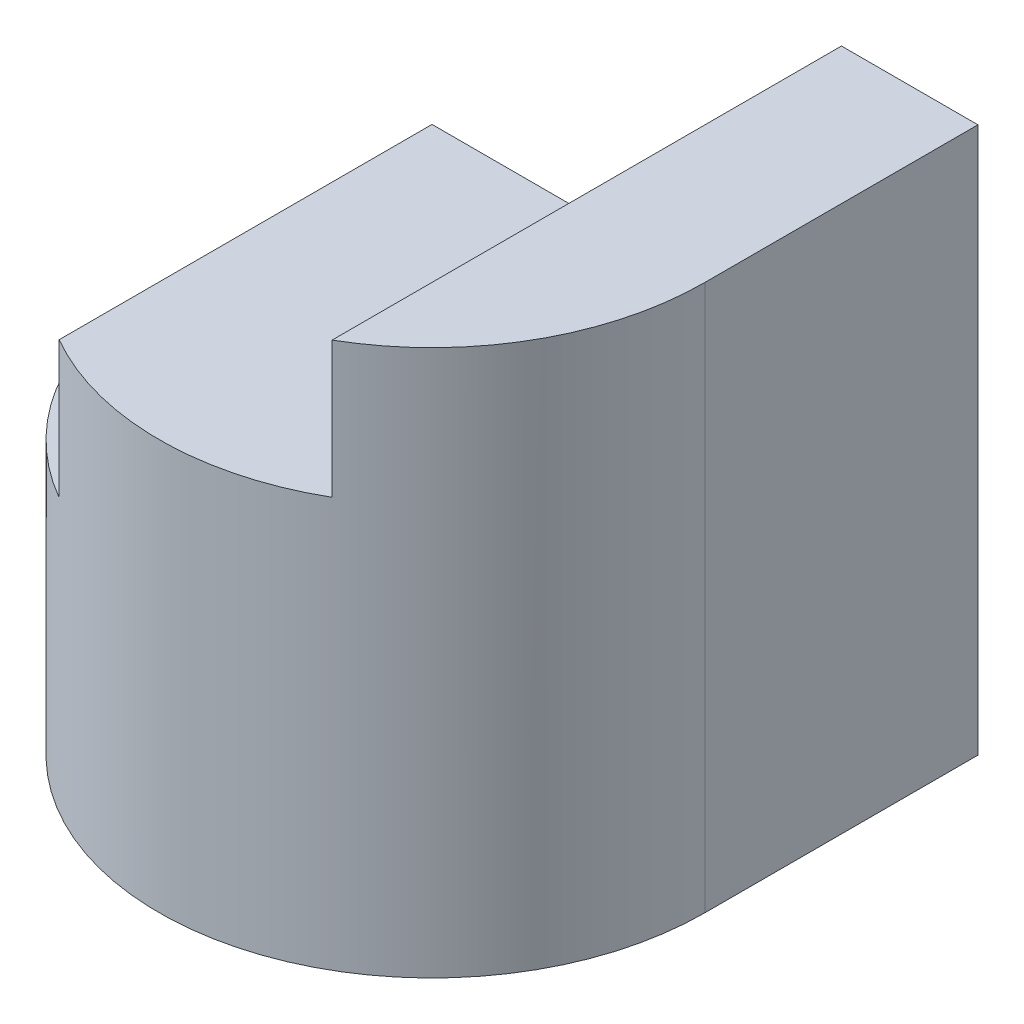
ISO-10303-21;
HEADER;
FILE_DESCRIPTION(('STEP AP214'),'2;1');
FILE_NAME('part.step','',(''),(''),'','','');
FILE_SCHEMA(('AUTOMOTIVE_DESIGN { 1 0 10303 214 1 1 1 1 }'));
ENDSEC;
DATA;
#1=APPLICATION_CONTEXT('core data for automotive mechanical design processes');
#2=APPLICATION_PROTOCOL_DEFINITION('international standard','automotive_design',2000,#1);
#3=PRODUCT_CONTEXT('',#1,'mechanical');
#4=PRODUCT('Part','Part','',(#3));
#5=PRODUCT_RELATED_PRODUCT_CATEGORY('part','',(#4));
#6=PRODUCT_DEFINITION_FORMATION('','',#4);
#7=PRODUCT_DEFINITION_CONTEXT('part definition',#1,'design');
#8=PRODUCT_DEFINITION('design','',#6,#7);
#9=PRODUCT_DEFINITION_SHAPE('','',#8);
#10=(LENGTH_UNIT() NAMED_UNIT(*) SI_UNIT(.MILLI.,.METRE.));
#11=(NAMED_UNIT(*) PLANE_ANGLE_UNIT() SI_UNIT($,.RADIAN.));
#12=(NAMED_UNIT(*) SI_UNIT($,.STERADIAN.) SOLID_ANGLE_UNIT());
#13=UNCERTAINTY_MEASURE_WITH_UNIT(LENGTH_MEASURE(1.E-05),#10,'distance_accuracy_value','');
#14=(GEOMETRIC_REPRESENTATION_CONTEXT(3) GLOBAL_UNCERTAINTY_ASSIGNED_CONTEXT((#13)) GLOBAL_UNIT_ASSIGNED_CONTEXT((#10,
#11,#12)) REPRESENTATION_CONTEXT('',''));
#15=CARTESIAN_POINT('',(0.,0.,0.));
#16=DIRECTION('',(0.,0.,1.));
#17=DIRECTION('',(1.,0.,0.));
#18=AXIS2_PLACEMENT_3D('',#15,#16,#17);
#19=CARTESIAN_POINT('',(-1.,4.,-2.));
#20=DIRECTION('',(0.,0.,1.));
#21=DIRECTION('',(1.,0.,0.));
#22=AXIS2_PLACEMENT_3D('',#19,#20,#21);
#23=PLANE('',#22);
#24=DIRECTION('',(0.,-1.,0.));
#25=VECTOR('',#24,1.);
#26=CARTESIAN_POINT('',(-2.,4.,-2.));
#27=LINE('',#26,#25);
#28=CARTESIAN_POINT('',(-2.,2.,-2.));
#29=VERTEX_POINT('',#28);
#30=CARTESIAN_POINT('',(-2.,0.,-2.));
#31=VERTEX_POINT('',#30);
#32=EDGE_CURVE('E40',#29,#31,#27,.T.);
#33=ORIENTED_EDGE('',*,*,#32,.F.);
#34=DIRECTION('',(-1.,0.,0.));
#35=VECTOR('',#34,1.);
#36=CARTESIAN_POINT('',(-1.,2.,-2.));
#37=LINE('',#36,#35);
#38=CARTESIAN_POINT('',(-1.,2.,-2.));
#39=VERTEX_POINT('',#38);
#40=EDGE_CURVE('E120',#39,#29,#37,.T.);
#41=ORIENTED_EDGE('',*,*,#40,.F.);
#42=DIRECTION('',(0.,-1.,0.));
#43=VECTOR('',#42,1.);
#44=CARTESIAN_POINT('',(-1.,4.,-2.));
#45=LINE('',#44,#43);
#46=CARTESIAN_POINT('',(-1.,0.,-2.));
#47=VERTEX_POINT('',#46);
#48=EDGE_CURVE('E86',#39,#47,#45,.T.);
#49=ORIENTED_EDGE('',*,*,#48,.T.);
#50=DIRECTION('',(-1.,0.,0.));
#51=VECTOR('',#50,1.);
#52=CARTESIAN_POINT('',(-1.,0.,-2.));
#53=LINE('',#52,#51);
#54=EDGE_CURVE('E162',#47,#31,#53,.T.);
#55=ORIENTED_EDGE('',*,*,#54,.T.);
#56=EDGE_LOOP('',(#33,#41,#49,#55));
#57=FACE_BOUND('',#56,.T.);
#58=ADVANCED_FACE('F33',(#57),#23,.F.);
#59=CARTESIAN_POINT('',(-2.,4.,-2.));
#60=DIRECTION('',(1.,0.,0.));
#61=DIRECTION('',(0.,0.,-1.));
#62=AXIS2_PLACEMENT_3D('',#59,#60,#61);
#63=PLANE('',#62);
#64=DIRECTION('',(0.,-1.,0.));
#65=VECTOR('',#64,1.);
#66=CARTESIAN_POINT('',(-2.,4.,0.));
#67=LINE('',#66,#65);
#68=CARTESIAN_POINT('',(-2.,2.,0.));
#69=VERTEX_POINT('',#68);
#70=CARTESIAN_POINT('',(-2.,0.,0.));
#71=VERTEX_POINT('',#70);
#72=EDGE_CURVE('E151',#69,#71,#67,.T.);
#73=ORIENTED_EDGE('',*,*,#72,.F.);
#74=DIRECTION('',(0.,0.,-1.));
#75=VECTOR('',#74,1.);
#76=CARTESIAN_POINT('',(-2.,2.,2.));
#77=LINE('',#76,#75);
#78=EDGE_CURVE('E159',#69,#29,#77,.T.);
#79=ORIENTED_EDGE('',*,*,#78,.T.);
#80=ORIENTED_EDGE('',*,*,#32,.T.);
#81=DIRECTION('',(0.,0.,1.));
#82=VECTOR('',#81,1.);
#83=CARTESIAN_POINT('',(-2.,0.,-2.));
#84=LINE('',#83,#82);
#85=EDGE_CURVE('E157',#31,#71,#84,.T.);
#86=ORIENTED_EDGE('',*,*,#85,.T.);
#87=EDGE_LOOP('',(#73,#79,#80,#86));
#88=FACE_BOUND('',#87,.T.);
#89=ADVANCED_FACE('F156',(#88),#63,.F.);
#90=CARTESIAN_POINT('',(0.,4.,0.));
#91=DIRECTION('',(0.,-1.,0.));
#92=DIRECTION('',(0.,0.,-1.));
#93=AXIS2_PLACEMENT_3D('',#90,#91,#92);
#94=CYLINDRICAL_SURFACE('',#93,2.);
#95=DIRECTION('',(0.,-1.,0.));
#96=VECTOR('',#95,1.);
#97=CARTESIAN_POINT('',(1.,4.,1.73205080756888));
#98=LINE('',#97,#96);
#99=CARTESIAN_POINT('',(1.,4.,1.73205080756888));
#100=VERTEX_POINT('',#99);
#101=CARTESIAN_POINT('',(1.,3.00245953648843,1.73205080756888));
#102=VERTEX_POINT('',#101);
#103=EDGE_CURVE('E196',#100,#102,#98,.T.);
#104=ORIENTED_EDGE('',*,*,#103,.T.);
#105=CARTESIAN_POINT('',(0.,3.00245953648843,0.));
#106=DIRECTION('',(0.,-1.,0.));
#107=DIRECTION('',(0.,0.,-1.));
#108=AXIS2_PLACEMENT_3D('',#105,#106,#107);
#109=CIRCLE('',#108,2.);
#110=CARTESIAN_POINT('',(-0.999999999999999,3.00245953648843,1.73205080756888));
#111=VERTEX_POINT('',#110);
#112=EDGE_CURVE('E191',#102,#111,#109,.T.);
#113=ORIENTED_EDGE('',*,*,#112,.T.);
#114=DIRECTION('',(0.,-1.,0.));
#115=VECTOR('',#114,1.);
#116=CARTESIAN_POINT('',(-0.999999999999999,4.,1.73205080756888));
#117=LINE('',#116,#115);
#118=CARTESIAN_POINT('',(-0.999999999999999,2.,1.73205080756888));
#119=VERTEX_POINT('',#118);
#120=EDGE_CURVE('E166',#111,#119,#117,.T.);
#121=ORIENTED_EDGE('',*,*,#120,.T.);
#122=CARTESIAN_POINT('',(0.,2.,0.));
#123=DIRECTION('',(0.,-1.,0.));
#124=DIRECTION('',(0.,0.,-1.));
#125=AXIS2_PLACEMENT_3D('',#122,#123,#124);
#126=CIRCLE('',#125,2.);
#127=EDGE_CURVE('E169',#119,#69,#126,.T.);
#128=ORIENTED_EDGE('',*,*,#127,.T.);
#129=ORIENTED_EDGE('',*,*,#72,.T.);
#130=CARTESIAN_POINT('',(0.,0.,0.));
#131=DIRECTION('',(0.,1.,0.));
#132=DIRECTION('',(0.,0.,1.));
#133=AXIS2_PLACEMENT_3D('',#130,#131,#132);
#134=CIRCLE('',#133,2.);
#135=CARTESIAN_POINT('',(2.,0.,0.));
#136=VERTEX_POINT('',#135);
#137=EDGE_CURVE('E164',#71,#136,#134,.T.);
#138=ORIENTED_EDGE('',*,*,#137,.T.);
#139=DIRECTION('',(0.,-1.,0.));
#140=VECTOR('',#139,1.);
#141=CARTESIAN_POINT('',(2.,4.,0.));
#142=LINE('',#141,#140);
#143=CARTESIAN_POINT('',(2.,4.,0.));
#144=VERTEX_POINT('',#143);
#145=EDGE_CURVE('E148',#144,#136,#142,.T.);
#146=ORIENTED_EDGE('',*,*,#145,.F.);
#147=CARTESIAN_POINT('',(0.,4.,0.));
#148=DIRECTION('',(0.,1.,0.));
#149=DIRECTION('',(0.,0.,1.));
#150=AXIS2_PLACEMENT_3D('',#147,#148,#149);
#151=CIRCLE('',#150,2.);
#152=EDGE_CURVE('E89',#100,#144,#151,.T.);
#153=ORIENTED_EDGE('',*,*,#152,.F.);
#154=EDGE_LOOP('',(#104,#113,#121,#128,#129,#138,#146,#153));
#155=FACE_BOUND('',#154,.T.);
#156=ADVANCED_FACE('F224',(#155),#94,.T.);
#157=CARTESIAN_POINT('',(2.,4.,0.));
#158=DIRECTION('',(-1.,0.,0.));
#159=DIRECTION('',(0.,0.,1.));
#160=AXIS2_PLACEMENT_3D('',#157,#158,#159);
#161=PLANE('',#160);
#162=DIRECTION('',(0.,0.,-1.));
#163=VECTOR('',#162,1.);
#164=CARTESIAN_POINT('',(2.,0.,0.));
#165=LINE('',#164,#163);
#166=CARTESIAN_POINT('',(2.,0.,-2.));
#167=VERTEX_POINT('',#166);
#168=EDGE_CURVE('E174',#136,#167,#165,.T.);
#169=ORIENTED_EDGE('',*,*,#168,.T.);
#170=DIRECTION('',(0.,-1.,0.));
#171=VECTOR('',#170,1.);
#172=CARTESIAN_POINT('',(2.,4.,-2.));
#173=LINE('',#172,#171);
#174=CARTESIAN_POINT('',(2.,4.,-2.));
#175=VERTEX_POINT('',#174);
#176=EDGE_CURVE('E145',#175,#167,#173,.T.);
#177=ORIENTED_EDGE('',*,*,#176,.F.);
#178=DIRECTION('',(0.,0.,-1.));
#179=VECTOR('',#178,1.);
#180=CARTESIAN_POINT('',(2.,4.,0.));
#181=LINE('',#180,#179);
#182=EDGE_CURVE('E185',#144,#175,#181,.T.);
#183=ORIENTED_EDGE('',*,*,#182,.F.);
#184=ORIENTED_EDGE('',*,*,#145,.T.);
#185=EDGE_LOOP('',(#169,#177,#183,#184));
#186=FACE_BOUND('',#185,.T.);
#187=ADVANCED_FACE('F222',(#186),#161,.F.);
#188=CARTESIAN_POINT('',(2.,4.,-2.));
#189=DIRECTION('',(0.,0.,1.));
#190=DIRECTION('',(1.,0.,0.));
#191=AXIS2_PLACEMENT_3D('',#188,#189,#190);
#192=PLANE('',#191);
#193=DIRECTION('',(-1.,0.,0.));
#194=VECTOR('',#193,1.);
#195=CARTESIAN_POINT('',(2.,0.,-2.));
#196=LINE('',#195,#194);
#197=CARTESIAN_POINT('',(1.,0.,-2.));
#198=VERTEX_POINT('',#197);
#199=EDGE_CURVE('E176',#167,#198,#196,.T.);
#200=ORIENTED_EDGE('',*,*,#199,.T.);
#201=DIRECTION('',(0.,-1.,0.));
#202=VECTOR('',#201,1.);
#203=CARTESIAN_POINT('',(1.,4.,-2.));
#204=LINE('',#203,#202);
#205=CARTESIAN_POINT('',(1.,4.,-2.));
#206=VERTEX_POINT('',#205);
#207=EDGE_CURVE('E143',#206,#198,#204,.T.);
#208=ORIENTED_EDGE('',*,*,#207,.F.);
#209=DIRECTION('',(-1.,0.,0.));
#210=VECTOR('',#209,1.);
#211=CARTESIAN_POINT('',(2.,4.,-2.));
#212=LINE('',#211,#210);
#213=EDGE_CURVE('E53',#175,#206,#212,.T.);
#214=ORIENTED_EDGE('',*,*,#213,.F.);
#215=ORIENTED_EDGE('',*,*,#176,.T.);
#216=EDGE_LOOP('',(#200,#208,#214,#215));
#217=FACE_BOUND('',#216,.T.);
#218=ADVANCED_FACE('F218',(#217),#192,.F.);
#219=CARTESIAN_POINT('',(1.,4.,-2.));
#220=DIRECTION('',(1.,0.,0.));
#221=DIRECTION('',(0.,0.,-1.));
#222=AXIS2_PLACEMENT_3D('',#219,#220,#221);
#223=PLANE('',#222);
#224=DIRECTION('',(0.,-1.,0.));
#225=VECTOR('',#224,1.);
#226=CARTESIAN_POINT('',(1.,4.,-1.));
#227=LINE('',#226,#225);
#228=CARTESIAN_POINT('',(1.,3.00245953648843,-1.));
#229=VERTEX_POINT('',#228);
#230=CARTESIAN_POINT('',(1.,0.,-1.));
#231=VERTEX_POINT('',#230);
#232=EDGE_CURVE('E141',#229,#231,#227,.T.);
#233=ORIENTED_EDGE('',*,*,#232,.F.);
#234=DIRECTION('',(0.,0.,-1.));
#235=VECTOR('',#234,1.);
#236=CARTESIAN_POINT('',(1.,3.00245953648843,2.));
#237=LINE('',#236,#235);
#238=EDGE_CURVE('E127',#102,#229,#237,.T.);
#239=ORIENTED_EDGE('',*,*,#238,.F.);
#240=ORIENTED_EDGE('',*,*,#103,.F.);
#241=DIRECTION('',(0.,0.,1.));
#242=VECTOR('',#241,1.);
#243=CARTESIAN_POINT('',(1.,4.,-2.));
#244=LINE('',#243,#242);
#245=EDGE_CURVE('E47',#206,#100,#244,.T.);
#246=ORIENTED_EDGE('',*,*,#245,.F.);
#247=ORIENTED_EDGE('',*,*,#207,.T.);
#248=DIRECTION('',(0.,0.,1.));
#249=VECTOR('',#248,1.);
#250=CARTESIAN_POINT('',(1.,0.,-2.));
#251=LINE('',#250,#249);
#252=EDGE_CURVE('E179',#198,#231,#251,.T.);
#253=ORIENTED_EDGE('',*,*,#252,.T.);
#254=EDGE_LOOP('',(#233,#239,#240,#246,#247,#253));
#255=FACE_BOUND('',#254,.T.);
#256=ADVANCED_FACE('F214',(#255),#223,.F.);
#257=CARTESIAN_POINT('',(1.,4.,-1.));
#258=DIRECTION('',(0.,0.,1.));
#259=DIRECTION('',(1.,0.,0.));
#260=AXIS2_PLACEMENT_3D('',#257,#258,#259);
#261=PLANE('',#260);
#262=DIRECTION('',(0.,-1.,0.));
#263=VECTOR('',#262,1.);
#264=CARTESIAN_POINT('',(-1.,4.,-1.));
#265=LINE('',#264,#263);
#266=CARTESIAN_POINT('',(-1.,3.00245953648843,-1.));
#267=VERTEX_POINT('',#266);
#268=CARTESIAN_POINT('',(-1.,2.,-1.));
#269=VERTEX_POINT('',#268);
#270=EDGE_CURVE('E135',#267,#269,#265,.T.);
#271=ORIENTED_EDGE('',*,*,#270,.F.);
#272=DIRECTION('',(1.,0.,0.));
#273=VECTOR('',#272,1.);
#274=CARTESIAN_POINT('',(1.,3.00245953648843,-1.));
#275=LINE('',#274,#273);
#276=EDGE_CURVE('E193',#267,#229,#275,.T.);
#277=ORIENTED_EDGE('',*,*,#276,.T.);
#278=ORIENTED_EDGE('',*,*,#232,.T.);
#279=DIRECTION('',(-1.,0.,0.));
#280=VECTOR('',#279,1.);
#281=CARTESIAN_POINT('',(1.,0.,-1.));
#282=LINE('',#281,#280);
#283=CARTESIAN_POINT('',(-1.,0.,-1.));
#284=VERTEX_POINT('',#283);
#285=EDGE_CURVE('E181',#231,#284,#282,.T.);
#286=ORIENTED_EDGE('',*,*,#285,.T.);
#287=EDGE_CURVE('E133',#269,#284,#265,.T.);
#288=ORIENTED_EDGE('',*,*,#287,.F.);
#289=EDGE_LOOP('',(#271,#277,#278,#286,#288));
#290=FACE_BOUND('',#289,.T.);
#291=ADVANCED_FACE('F210',(#290),#261,.F.);
#292=CARTESIAN_POINT('',(-1.,4.,-1.));
#293=DIRECTION('',(-1.,0.,0.));
#294=DIRECTION('',(0.,0.,1.));
#295=AXIS2_PLACEMENT_3D('',#292,#293,#294);
#296=PLANE('',#295);
#297=ORIENTED_EDGE('',*,*,#48,.F.);
#298=DIRECTION('',(0.,0.,1.));
#299=VECTOR('',#298,1.);
#300=CARTESIAN_POINT('',(-1.,2.,-1.));
#301=LINE('',#300,#299);
#302=EDGE_CURVE('E11',#39,#269,#301,.T.);
#303=ORIENTED_EDGE('',*,*,#302,.T.);
#304=ORIENTED_EDGE('',*,*,#287,.T.);
#305=DIRECTION('',(0.,0.,-1.));
#306=VECTOR('',#305,1.);
#307=CARTESIAN_POINT('',(-1.,0.,-1.));
#308=LINE('',#307,#306);
#309=EDGE_CURVE('E131',#284,#47,#308,.T.);
#310=ORIENTED_EDGE('',*,*,#309,.T.);
#311=EDGE_LOOP('',(#297,#303,#304,#310));
#312=FACE_BOUND('',#311,.T.);
#313=ADVANCED_FACE('F129',(#312),#296,.F.);
#314=CARTESIAN_POINT('',(0.,4.,0.));
#315=DIRECTION('',(0.,1.,0.));
#316=DIRECTION('',(0.,0.,1.));
#317=AXIS2_PLACEMENT_3D('',#314,#315,#316);
#318=PLANE('',#317);
#319=ORIENTED_EDGE('',*,*,#245,.T.);
#320=ORIENTED_EDGE('',*,*,#152,.T.);
#321=ORIENTED_EDGE('',*,*,#182,.T.);
#322=ORIENTED_EDGE('',*,*,#213,.T.);
#323=EDGE_LOOP('',(#319,#320,#321,#322));
#324=FACE_BOUND('',#323,.T.);
#325=ADVANCED_FACE('F253',(#324),#318,.T.);
#326=CARTESIAN_POINT('',(0.,0.,0.));
#327=DIRECTION('',(0.,1.,0.));
#328=DIRECTION('',(0.,0.,1.));
#329=AXIS2_PLACEMENT_3D('',#326,#327,#328);
#330=PLANE('',#329);
#331=ORIENTED_EDGE('',*,*,#54,.F.);
#332=ORIENTED_EDGE('',*,*,#309,.F.);
#333=ORIENTED_EDGE('',*,*,#285,.F.);
#334=ORIENTED_EDGE('',*,*,#252,.F.);
#335=ORIENTED_EDGE('',*,*,#199,.F.);
#336=ORIENTED_EDGE('',*,*,#168,.F.);
#337=ORIENTED_EDGE('',*,*,#137,.F.);
#338=ORIENTED_EDGE('',*,*,#85,.F.);
#339=EDGE_LOOP('',(#331,#332,#333,#334,#335,#336,#337,#338));
#340=FACE_BOUND('',#339,.T.);
#341=ADVANCED_FACE('F161',(#340),#330,.F.);
#342=CARTESIAN_POINT('',(-0.999999999999999,3.00245953648843,2.));
#343=DIRECTION('',(1.,0.,0.));
#344=DIRECTION('',(0.,0.,-1.));
#345=AXIS2_PLACEMENT_3D('',#342,#343,#344);
#346=PLANE('',#345);
#347=DIRECTION('',(0.,0.,-1.));
#348=VECTOR('',#347,1.);
#349=CARTESIAN_POINT('',(-0.999999999999999,3.00245953648843,2.));
#350=LINE('',#349,#348);
#351=EDGE_CURVE('E200',#111,#267,#350,.T.);
#352=ORIENTED_EDGE('',*,*,#351,.T.);
#353=ORIENTED_EDGE('',*,*,#270,.T.);
#354=DIRECTION('',(0.,0.,-1.));
#355=VECTOR('',#354,1.);
#356=CARTESIAN_POINT('',(-0.999999999999999,2.,2.));
#357=LINE('',#356,#355);
#358=EDGE_CURVE('E123',#119,#269,#357,.T.);
#359=ORIENTED_EDGE('',*,*,#358,.F.);
#360=ORIENTED_EDGE('',*,*,#120,.F.);
#361=EDGE_LOOP('',(#352,#353,#359,#360));
#362=FACE_BOUND('',#361,.T.);
#363=ADVANCED_FACE('F208',(#362),#346,.F.);
#364=CARTESIAN_POINT('',(-0.999999999999999,2.,2.));
#365=DIRECTION('',(0.,-1.,0.));
#366=DIRECTION('',(0.,0.,-1.));
#367=AXIS2_PLACEMENT_3D('',#364,#365,#366);
#368=PLANE('',#367);
#369=ORIENTED_EDGE('',*,*,#358,.T.);
#370=ORIENTED_EDGE('',*,*,#302,.F.);
#371=ORIENTED_EDGE('',*,*,#40,.T.);
#372=ORIENTED_EDGE('',*,*,#78,.F.);
#373=ORIENTED_EDGE('',*,*,#127,.F.);
#374=EDGE_LOOP('',(#369,#370,#371,#372,#373));
#375=FACE_BOUND('',#374,.T.);
#376=ADVANCED_FACE('F119',(#375),#368,.F.);
#377=CARTESIAN_POINT('',(1.,3.00245953648843,2.));
#378=DIRECTION('',(0.,-1.,0.));
#379=DIRECTION('',(0.,0.,-1.));
#380=AXIS2_PLACEMENT_3D('',#377,#378,#379);
#381=PLANE('',#380);
#382=ORIENTED_EDGE('',*,*,#238,.T.);
#383=ORIENTED_EDGE('',*,*,#276,.F.);
#384=ORIENTED_EDGE('',*,*,#351,.F.);
#385=ORIENTED_EDGE('',*,*,#112,.F.);
#386=EDGE_LOOP('',(#382,#383,#384,#385));
#387=FACE_BOUND('',#386,.T.);
#388=ADVANCED_FACE('F225',(#387),#381,.F.);
#389=CLOSED_SHELL('',(#58,#89,#156,#187,#218,#256,#291,#313,#325,#341,#363,#376,#388));
#390=MANIFOLD_SOLID_BREP('B2',#389);
#391=ADVANCED_BREP_SHAPE_REPRESENTATION('',(#18,#390),#14);
#392=SHAPE_DEFINITION_REPRESENTATION(#9,#391);
ENDSEC;
END-ISO-10303-21;
